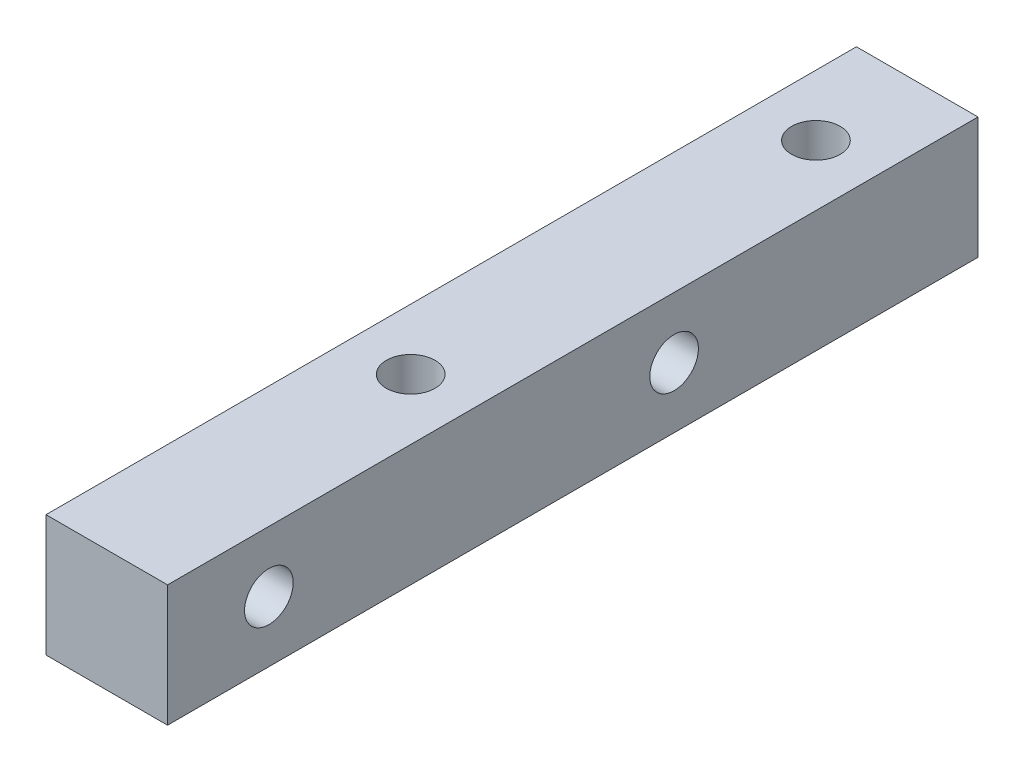
ISO-10303-21;
HEADER;
FILE_DESCRIPTION(('STEP AP214'),'2;1');
FILE_NAME('part.step','',(''),(''),'','','');
FILE_SCHEMA(('AUTOMOTIVE_DESIGN { 1 0 10303 214 1 1 1 1 }'));
ENDSEC;
DATA;
#1=APPLICATION_CONTEXT('core data for automotive mechanical design processes');
#2=APPLICATION_PROTOCOL_DEFINITION('international standard','automotive_design',2000,#1);
#3=PRODUCT_CONTEXT('',#1,'mechanical');
#4=PRODUCT('Part','Part','',(#3));
#5=PRODUCT_RELATED_PRODUCT_CATEGORY('part','',(#4));
#6=PRODUCT_DEFINITION_FORMATION('','',#4);
#7=PRODUCT_DEFINITION_CONTEXT('part definition',#1,'design');
#8=PRODUCT_DEFINITION('design','',#6,#7);
#9=PRODUCT_DEFINITION_SHAPE('','',#8);
#10=(LENGTH_UNIT() NAMED_UNIT(*) SI_UNIT(.MILLI.,.METRE.));
#11=(NAMED_UNIT(*) PLANE_ANGLE_UNIT() SI_UNIT($,.RADIAN.));
#12=(NAMED_UNIT(*) SI_UNIT($,.STERADIAN.) SOLID_ANGLE_UNIT());
#13=UNCERTAINTY_MEASURE_WITH_UNIT(LENGTH_MEASURE(1.E-05),#10,'distance_accuracy_value','');
#14=(GEOMETRIC_REPRESENTATION_CONTEXT(3) GLOBAL_UNCERTAINTY_ASSIGNED_CONTEXT((#13)) GLOBAL_UNIT_ASSIGNED_CONTEXT((#10,
#11,#12)) REPRESENTATION_CONTEXT('',''));
#15=CARTESIAN_POINT('',(0.,0.,0.));
#16=DIRECTION('',(0.,0.,1.));
#17=DIRECTION('',(1.,0.,0.));
#18=AXIS2_PLACEMENT_3D('',#15,#16,#17);
#19=CARTESIAN_POINT('',(0.,0.,40.));
#20=DIRECTION('',(1.,0.,0.));
#21=DIRECTION('',(0.,0.,-1.));
#22=AXIS2_PLACEMENT_3D('',#19,#20,#21);
#23=PLANE('',#22);
#24=CARTESIAN_POINT('',(0.,3.,35.));
#25=DIRECTION('',(-1.,0.,0.));
#26=DIRECTION('',(0.,0.,1.));
#27=AXIS2_PLACEMENT_3D('',#24,#25,#26);
#28=CIRCLE('',#27,1.2);
#29=CARTESIAN_POINT('',(0.,3.,36.2));
#30=VERTEX_POINT('',#29);
#31=EDGE_CURVE('E112',#30,#30,#28,.T.);
#32=ORIENTED_EDGE('',*,*,#31,.F.);
#33=EDGE_LOOP('',(#32));
#34=FACE_BOUND('',#33,.T.);
#35=CARTESIAN_POINT('',(0.,3.,15.));
#36=DIRECTION('',(-1.,0.,0.));
#37=DIRECTION('',(0.,0.,1.));
#38=AXIS2_PLACEMENT_3D('',#35,#36,#37);
#39=CIRCLE('',#38,1.2);
#40=CARTESIAN_POINT('',(0.,3.,16.2));
#41=VERTEX_POINT('',#40);
#42=EDGE_CURVE('E118',#41,#41,#39,.T.);
#43=ORIENTED_EDGE('',*,*,#42,.F.);
#44=EDGE_LOOP('',(#43));
#45=FACE_BOUND('',#44,.T.);
#46=DIRECTION('',(0.,-1.,0.));
#47=VECTOR('',#46,1.);
#48=CARTESIAN_POINT('',(0.,0.,0.));
#49=LINE('',#48,#47);
#50=CARTESIAN_POINT('',(0.,6.,0.));
#51=VERTEX_POINT('',#50);
#52=CARTESIAN_POINT('',(0.,0.,0.));
#53=VERTEX_POINT('',#52);
#54=EDGE_CURVE('E102',#51,#53,#49,.T.);
#55=ORIENTED_EDGE('',*,*,#54,.T.);
#56=DIRECTION('',(0.,0.,-1.));
#57=VECTOR('',#56,1.);
#58=CARTESIAN_POINT('',(0.,0.,40.));
#59=LINE('',#58,#57);
#60=CARTESIAN_POINT('',(0.,0.,40.));
#61=VERTEX_POINT('',#60);
#62=EDGE_CURVE('E11',#61,#53,#59,.T.);
#63=ORIENTED_EDGE('',*,*,#62,.F.);
#64=DIRECTION('',(0.,-1.,0.));
#65=VECTOR('',#64,1.);
#66=CARTESIAN_POINT('',(0.,0.,40.));
#67=LINE('',#66,#65);
#68=CARTESIAN_POINT('',(0.,6.,40.));
#69=VERTEX_POINT('',#68);
#70=EDGE_CURVE('E89',#69,#61,#67,.T.);
#71=ORIENTED_EDGE('',*,*,#70,.F.);
#72=DIRECTION('',(0.,0.,-1.));
#73=VECTOR('',#72,1.);
#74=CARTESIAN_POINT('',(0.,6.,40.));
#75=LINE('',#74,#73);
#76=EDGE_CURVE('E98',#69,#51,#75,.T.);
#77=ORIENTED_EDGE('',*,*,#76,.T.);
#78=EDGE_LOOP('',(#55,#63,#71,#77));
#79=FACE_BOUND('',#78,.T.);
#80=ADVANCED_FACE('F36',(#34,#45,#79),#23,.F.);
#81=CARTESIAN_POINT('',(0.,0.,40.));
#82=DIRECTION('',(0.,1.,0.));
#83=DIRECTION('',(0.,0.,1.));
#84=AXIS2_PLACEMENT_3D('',#81,#82,#83);
#85=PLANE('',#84);
#86=CARTESIAN_POINT('',(3.,0.,5.));
#87=DIRECTION('',(0.,1.,0.));
#88=DIRECTION('',(0.,0.,1.));
#89=AXIS2_PLACEMENT_3D('',#86,#87,#88);
#90=CIRCLE('',#89,1.2);
#91=CARTESIAN_POINT('',(3.,0.,6.2));
#92=VERTEX_POINT('',#91);
#93=EDGE_CURVE('E105',#92,#92,#90,.T.);
#94=ORIENTED_EDGE('',*,*,#93,.T.);
#95=EDGE_LOOP('',(#94));
#96=FACE_BOUND('',#95,.T.);
#97=CARTESIAN_POINT('',(3.,0.,25.));
#98=DIRECTION('',(0.,1.,0.));
#99=DIRECTION('',(0.,0.,1.));
#100=AXIS2_PLACEMENT_3D('',#97,#98,#99);
#101=CIRCLE('',#100,1.2);
#102=CARTESIAN_POINT('',(3.,0.,26.2));
#103=VERTEX_POINT('',#102);
#104=EDGE_CURVE('E128',#103,#103,#101,.T.);
#105=ORIENTED_EDGE('',*,*,#104,.T.);
#106=EDGE_LOOP('',(#105));
#107=FACE_BOUND('',#106,.T.);
#108=DIRECTION('',(1.,0.,0.));
#109=VECTOR('',#108,1.);
#110=CARTESIAN_POINT('',(0.,0.,0.));
#111=LINE('',#110,#109);
#112=CARTESIAN_POINT('',(6.,0.,0.));
#113=VERTEX_POINT('',#112);
#114=EDGE_CURVE('E93',#53,#113,#111,.T.);
#115=ORIENTED_EDGE('',*,*,#114,.T.);
#116=DIRECTION('',(0.,0.,-1.));
#117=VECTOR('',#116,1.);
#118=CARTESIAN_POINT('',(6.,0.,40.));
#119=LINE('',#118,#117);
#120=CARTESIAN_POINT('',(6.,0.,40.));
#121=VERTEX_POINT('',#120);
#122=EDGE_CURVE('E45',#121,#113,#119,.T.);
#123=ORIENTED_EDGE('',*,*,#122,.F.);
#124=DIRECTION('',(1.,0.,0.));
#125=VECTOR('',#124,1.);
#126=CARTESIAN_POINT('',(0.,0.,40.));
#127=LINE('',#126,#125);
#128=EDGE_CURVE('E84',#61,#121,#127,.T.);
#129=ORIENTED_EDGE('',*,*,#128,.F.);
#130=ORIENTED_EDGE('',*,*,#62,.T.);
#131=EDGE_LOOP('',(#115,#123,#129,#130));
#132=FACE_BOUND('',#131,.T.);
#133=ADVANCED_FACE('F92',(#96,#107,#132),#85,.F.);
#134=CARTESIAN_POINT('',(6.,0.,40.));
#135=DIRECTION('',(-1.,0.,0.));
#136=DIRECTION('',(0.,0.,1.));
#137=AXIS2_PLACEMENT_3D('',#134,#135,#136);
#138=PLANE('',#137);
#139=CARTESIAN_POINT('',(6.,3.,35.));
#140=DIRECTION('',(-1.,0.,0.));
#141=DIRECTION('',(0.,0.,1.));
#142=AXIS2_PLACEMENT_3D('',#139,#140,#141);
#143=CIRCLE('',#142,1.2);
#144=CARTESIAN_POINT('',(6.,3.,36.2));
#145=VERTEX_POINT('',#144);
#146=EDGE_CURVE('E39',#145,#145,#143,.T.);
#147=ORIENTED_EDGE('',*,*,#146,.T.);
#148=EDGE_LOOP('',(#147));
#149=FACE_BOUND('',#148,.T.);
#150=CARTESIAN_POINT('',(6.,3.,15.));
#151=DIRECTION('',(-1.,0.,0.));
#152=DIRECTION('',(0.,0.,1.));
#153=AXIS2_PLACEMENT_3D('',#150,#151,#152);
#154=CIRCLE('',#153,1.2);
#155=CARTESIAN_POINT('',(6.,3.,16.2));
#156=VERTEX_POINT('',#155);
#157=EDGE_CURVE('E110',#156,#156,#154,.T.);
#158=ORIENTED_EDGE('',*,*,#157,.T.);
#159=EDGE_LOOP('',(#158));
#160=FACE_BOUND('',#159,.T.);
#161=DIRECTION('',(0.,1.,0.));
#162=VECTOR('',#161,1.);
#163=CARTESIAN_POINT('',(6.,0.,0.));
#164=LINE('',#163,#162);
#165=CARTESIAN_POINT('',(6.,6.,0.));
#166=VERTEX_POINT('',#165);
#167=EDGE_CURVE('E71',#113,#166,#164,.T.);
#168=ORIENTED_EDGE('',*,*,#167,.T.);
#169=DIRECTION('',(0.,0.,-1.));
#170=VECTOR('',#169,1.);
#171=CARTESIAN_POINT('',(6.,6.,40.));
#172=LINE('',#171,#170);
#173=CARTESIAN_POINT('',(6.,6.,40.));
#174=VERTEX_POINT('',#173);
#175=EDGE_CURVE('E94',#174,#166,#172,.T.);
#176=ORIENTED_EDGE('',*,*,#175,.F.);
#177=DIRECTION('',(0.,1.,0.));
#178=VECTOR('',#177,1.);
#179=CARTESIAN_POINT('',(6.,0.,40.));
#180=LINE('',#179,#178);
#181=EDGE_CURVE('E87',#121,#174,#180,.T.);
#182=ORIENTED_EDGE('',*,*,#181,.F.);
#183=ORIENTED_EDGE('',*,*,#122,.T.);
#184=EDGE_LOOP('',(#168,#176,#182,#183));
#185=FACE_BOUND('',#184,.T.);
#186=ADVANCED_FACE('F96',(#149,#160,#185),#138,.F.);
#187=CARTESIAN_POINT('',(0.,6.,40.));
#188=DIRECTION('',(0.,-1.,0.));
#189=DIRECTION('',(0.,0.,-1.));
#190=AXIS2_PLACEMENT_3D('',#187,#188,#189);
#191=PLANE('',#190);
#192=CARTESIAN_POINT('',(3.,6.,5.));
#193=DIRECTION('',(0.,1.,0.));
#194=DIRECTION('',(0.,0.,1.));
#195=AXIS2_PLACEMENT_3D('',#192,#193,#194);
#196=CIRCLE('',#195,1.2);
#197=CARTESIAN_POINT('',(3.,6.,6.2));
#198=VERTEX_POINT('',#197);
#199=EDGE_CURVE('E125',#198,#198,#196,.T.);
#200=ORIENTED_EDGE('',*,*,#199,.F.);
#201=EDGE_LOOP('',(#200));
#202=FACE_BOUND('',#201,.T.);
#203=CARTESIAN_POINT('',(3.,6.,25.));
#204=DIRECTION('',(0.,1.,0.));
#205=DIRECTION('',(0.,0.,1.));
#206=AXIS2_PLACEMENT_3D('',#203,#204,#205);
#207=CIRCLE('',#206,1.2);
#208=CARTESIAN_POINT('',(3.,6.,26.2));
#209=VERTEX_POINT('',#208);
#210=EDGE_CURVE('E116',#209,#209,#207,.T.);
#211=ORIENTED_EDGE('',*,*,#210,.F.);
#212=EDGE_LOOP('',(#211));
#213=FACE_BOUND('',#212,.T.);
#214=DIRECTION('',(-1.,0.,0.));
#215=VECTOR('',#214,1.);
#216=CARTESIAN_POINT('',(0.,6.,0.));
#217=LINE('',#216,#215);
#218=EDGE_CURVE('E77',#166,#51,#217,.T.);
#219=ORIENTED_EDGE('',*,*,#218,.T.);
#220=ORIENTED_EDGE('',*,*,#76,.F.);
#221=DIRECTION('',(-1.,0.,0.));
#222=VECTOR('',#221,1.);
#223=CARTESIAN_POINT('',(0.,6.,40.));
#224=LINE('',#223,#222);
#225=EDGE_CURVE('E54',#174,#69,#224,.T.);
#226=ORIENTED_EDGE('',*,*,#225,.F.);
#227=ORIENTED_EDGE('',*,*,#175,.T.);
#228=EDGE_LOOP('',(#219,#220,#226,#227));
#229=FACE_BOUND('',#228,.T.);
#230=ADVANCED_FACE('F169',(#202,#213,#229),#191,.F.);
#231=CARTESIAN_POINT('',(0.,0.,40.));
#232=DIRECTION('',(0.,0.,-1.));
#233=DIRECTION('',(-1.,0.,0.));
#234=AXIS2_PLACEMENT_3D('',#231,#232,#233);
#235=PLANE('',#234);
#236=ORIENTED_EDGE('',*,*,#70,.T.);
#237=ORIENTED_EDGE('',*,*,#128,.T.);
#238=ORIENTED_EDGE('',*,*,#181,.T.);
#239=ORIENTED_EDGE('',*,*,#225,.T.);
#240=EDGE_LOOP('',(#236,#237,#238,#239));
#241=FACE_BOUND('',#240,.T.);
#242=ADVANCED_FACE('F85',(#241),#235,.F.);
#243=CARTESIAN_POINT('',(0.,0.,0.));
#244=DIRECTION('',(0.,0.,-1.));
#245=DIRECTION('',(-1.,0.,0.));
#246=AXIS2_PLACEMENT_3D('',#243,#244,#245);
#247=PLANE('',#246);
#248=ORIENTED_EDGE('',*,*,#54,.F.);
#249=ORIENTED_EDGE('',*,*,#218,.F.);
#250=ORIENTED_EDGE('',*,*,#167,.F.);
#251=ORIENTED_EDGE('',*,*,#114,.F.);
#252=EDGE_LOOP('',(#248,#249,#250,#251));
#253=FACE_BOUND('',#252,.T.);
#254=ADVANCED_FACE('F151',(#253),#247,.T.);
#255=CARTESIAN_POINT('',(3.,-44.,25.));
#256=DIRECTION('',(0.,1.,0.));
#257=DIRECTION('',(0.,0.,1.));
#258=AXIS2_PLACEMENT_3D('',#255,#256,#257);
#259=CYLINDRICAL_SURFACE('',#258,1.2);
#260=ORIENTED_EDGE('',*,*,#210,.T.);
#261=EDGE_LOOP('',(#260));
#262=FACE_BOUND('',#261,.T.);
#263=ORIENTED_EDGE('',*,*,#104,.F.);
#264=EDGE_LOOP('',(#263));
#265=FACE_BOUND('',#264,.T.);
#266=ADVANCED_FACE('F141',(#262,#265),#259,.F.);
#267=CARTESIAN_POINT('',(3.,-44.,5.));
#268=DIRECTION('',(0.,1.,0.));
#269=DIRECTION('',(0.,0.,1.));
#270=AXIS2_PLACEMENT_3D('',#267,#268,#269);
#271=CYLINDRICAL_SURFACE('',#270,1.2);
#272=ORIENTED_EDGE('',*,*,#199,.T.);
#273=EDGE_LOOP('',(#272));
#274=FACE_BOUND('',#273,.T.);
#275=ORIENTED_EDGE('',*,*,#93,.F.);
#276=EDGE_LOOP('',(#275));
#277=FACE_BOUND('',#276,.T.);
#278=ADVANCED_FACE('F138',(#274,#277),#271,.F.);
#279=CARTESIAN_POINT('',(50.,3.,15.));
#280=DIRECTION('',(-1.,0.,0.));
#281=DIRECTION('',(0.,0.,1.));
#282=AXIS2_PLACEMENT_3D('',#279,#280,#281);
#283=CYLINDRICAL_SURFACE('',#282,1.2);
#284=ORIENTED_EDGE('',*,*,#42,.T.);
#285=EDGE_LOOP('',(#284));
#286=FACE_BOUND('',#285,.T.);
#287=ORIENTED_EDGE('',*,*,#157,.F.);
#288=EDGE_LOOP('',(#287));
#289=FACE_BOUND('',#288,.T.);
#290=ADVANCED_FACE('F140',(#286,#289),#283,.F.);
#291=CARTESIAN_POINT('',(50.,3.,35.));
#292=DIRECTION('',(-1.,0.,0.));
#293=DIRECTION('',(0.,0.,1.));
#294=AXIS2_PLACEMENT_3D('',#291,#292,#293);
#295=CYLINDRICAL_SURFACE('',#294,1.2);
#296=ORIENTED_EDGE('',*,*,#31,.T.);
#297=EDGE_LOOP('',(#296));
#298=FACE_BOUND('',#297,.T.);
#299=ORIENTED_EDGE('',*,*,#146,.F.);
#300=EDGE_LOOP('',(#299));
#301=FACE_BOUND('',#300,.T.);
#302=ADVANCED_FACE('F148',(#298,#301),#295,.F.);
#303=CLOSED_SHELL('',(#80,#133,#186,#230,#242,#254,#266,#278,#290,#302));
#304=MANIFOLD_SOLID_BREP('B2',#303);
#305=ADVANCED_BREP_SHAPE_REPRESENTATION('',(#18,#304),#14);
#306=SHAPE_DEFINITION_REPRESENTATION(#9,#305);
ENDSEC;
END-ISO-10303-21;
